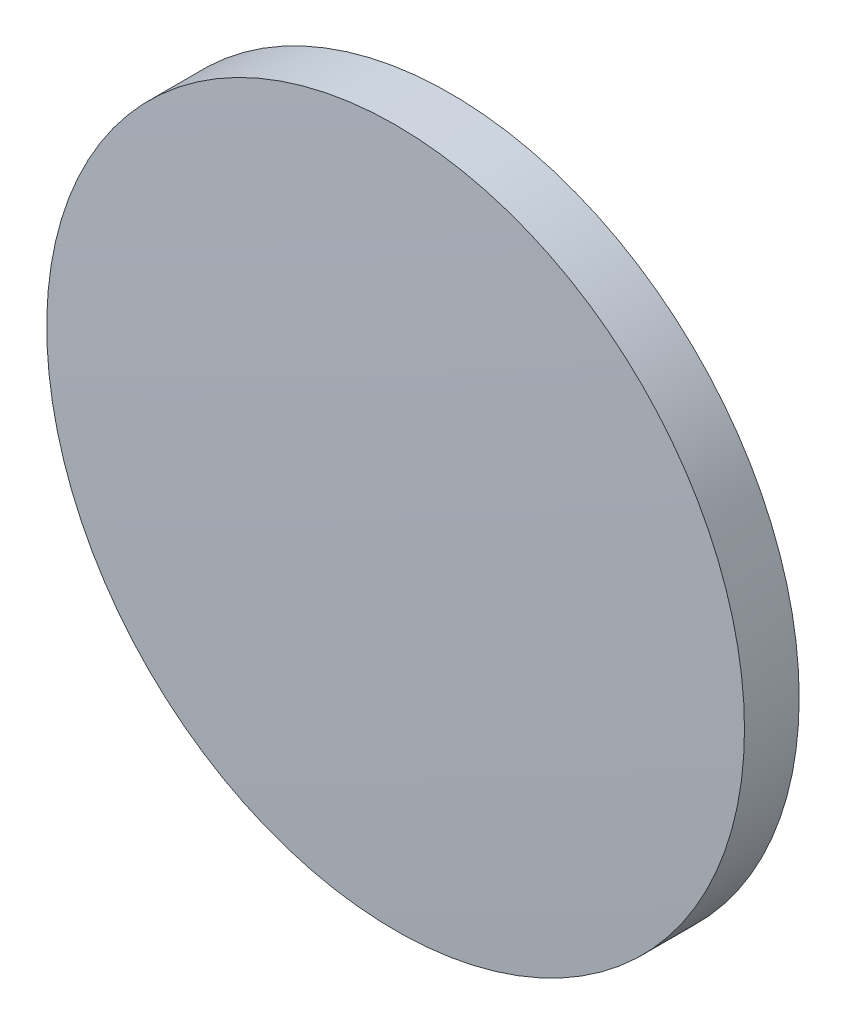
ISO-10303-21;
HEADER;
FILE_DESCRIPTION(('STEP AP214'),'2;1');
FILE_NAME('part.step','',(''),(''),'','','');
FILE_SCHEMA(('AUTOMOTIVE_DESIGN { 1 0 10303 214 1 1 1 1 }'));
ENDSEC;
DATA;
#1=APPLICATION_CONTEXT('core data for automotive mechanical design processes');
#2=APPLICATION_PROTOCOL_DEFINITION('international standard','automotive_design',2000,#1);
#3=PRODUCT_CONTEXT('',#1,'mechanical');
#4=PRODUCT('Part','Part','',(#3));
#5=PRODUCT_RELATED_PRODUCT_CATEGORY('part','',(#4));
#6=PRODUCT_DEFINITION_FORMATION('','',#4);
#7=PRODUCT_DEFINITION_CONTEXT('part definition',#1,'design');
#8=PRODUCT_DEFINITION('design','',#6,#7);
#9=PRODUCT_DEFINITION_SHAPE('','',#8);
#10=(LENGTH_UNIT() NAMED_UNIT(*) SI_UNIT(.MILLI.,.METRE.));
#11=(NAMED_UNIT(*) PLANE_ANGLE_UNIT() SI_UNIT($,.RADIAN.));
#12=(NAMED_UNIT(*) SI_UNIT($,.STERADIAN.) SOLID_ANGLE_UNIT());
#13=UNCERTAINTY_MEASURE_WITH_UNIT(LENGTH_MEASURE(1.E-05),#10,'distance_accuracy_value','');
#14=(GEOMETRIC_REPRESENTATION_CONTEXT(3) GLOBAL_UNCERTAINTY_ASSIGNED_CONTEXT((#13)) GLOBAL_UNIT_ASSIGNED_CONTEXT((#10,
#11,#12)) REPRESENTATION_CONTEXT('',''));
#15=CARTESIAN_POINT('',(0.,0.,0.));
#16=DIRECTION('',(0.,0.,1.));
#17=DIRECTION('',(1.,0.,0.));
#18=AXIS2_PLACEMENT_3D('',#15,#16,#17);
#19=CARTESIAN_POINT('',(0.,0.,-385.21));
#20=DIRECTION('',(0.,0.,1.));
#21=DIRECTION('',(0.,1.,0.));
#22=AXIS2_PLACEMENT_3D('',#19,#20,#21);
#23=SPHERICAL_SURFACE('',#22,386.31);
#24=CARTESIAN_POINT('',(0.,0.,0.89118634886371));
#25=DIRECTION('',(0.,0.,1.));
#26=DIRECTION('',(1.,0.,0.));
#27=AXIS2_PLACEMENT_3D('',#24,#25,#26);
#28=CIRCLE('',#27,12.7);
#29=CARTESIAN_POINT('',(12.7,0.,0.89118634886371));
#30=VERTEX_POINT('',#29);
#31=EDGE_CURVE('E8',#30,#30,#28,.T.);
#32=ORIENTED_EDGE('',*,*,#31,.T.);
#33=EDGE_LOOP('',(#32));
#34=FACE_BOUND('',#33,.T.);
#35=ADVANCED_FACE('F12',(#34),#23,.T.);
#36=CARTESIAN_POINT('',(0.,0.,4.30813204540037));
#37=DIRECTION('',(0.,0.,1.));
#38=DIRECTION('',(1.,0.,0.));
#39=AXIS2_PLACEMENT_3D('',#36,#37,#38);
#40=CYLINDRICAL_SURFACE('',#39,12.7);
#41=ORIENTED_EDGE('',*,*,#31,.F.);
#42=EDGE_LOOP('',(#41));
#43=FACE_BOUND('',#42,.T.);
#44=CARTESIAN_POINT('',(0.,0.,-1.1));
#45=DIRECTION('',(0.,0.,1.));
#46=DIRECTION('',(1.,0.,0.));
#47=AXIS2_PLACEMENT_3D('',#44,#45,#46);
#48=CIRCLE('',#47,12.7);
#49=CARTESIAN_POINT('',(12.7,0.,-1.1));
#50=VERTEX_POINT('',#49);
#51=EDGE_CURVE('E18',#50,#50,#48,.T.);
#52=ORIENTED_EDGE('',*,*,#51,.T.);
#53=EDGE_LOOP('',(#52));
#54=FACE_BOUND('',#53,.T.);
#55=ADVANCED_FACE('F24',(#43,#54),#40,.T.);
#56=CARTESIAN_POINT('',(0.,0.,-1.1));
#57=DIRECTION('',(0.,0.,1.));
#58=DIRECTION('',(1.,0.,0.));
#59=AXIS2_PLACEMENT_3D('',#56,#57,#58);
#60=PLANE('',#59);
#61=ORIENTED_EDGE('',*,*,#51,.F.);
#62=EDGE_LOOP('',(#61));
#63=FACE_BOUND('',#62,.T.);
#64=ADVANCED_FACE('F26',(#63),#60,.F.);
#65=CLOSED_SHELL('',(#35,#55,#64));
#66=MANIFOLD_SOLID_BREP('B1',#65);
#67=ADVANCED_BREP_SHAPE_REPRESENTATION('',(#18,#66),#14);
#68=SHAPE_DEFINITION_REPRESENTATION(#9,#67);
ENDSEC;
END-ISO-10303-21;
